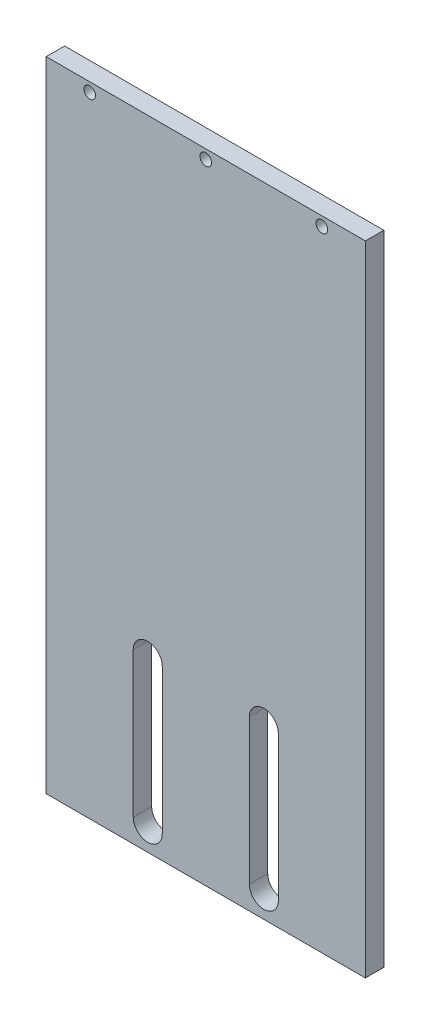
ISO-10303-21;
HEADER;
FILE_DESCRIPTION(('STEP AP214'),'2;1');
FILE_NAME('part.step','',(''),(''),'','','');
FILE_SCHEMA(('AUTOMOTIVE_DESIGN { 1 0 10303 214 1 1 1 1 }'));
ENDSEC;
DATA;
#1=APPLICATION_CONTEXT('core data for automotive mechanical design processes');
#2=APPLICATION_PROTOCOL_DEFINITION('international standard','automotive_design',2000,#1);
#3=PRODUCT_CONTEXT('',#1,'mechanical');
#4=PRODUCT('Part','Part','',(#3));
#5=PRODUCT_RELATED_PRODUCT_CATEGORY('part','',(#4));
#6=PRODUCT_DEFINITION_FORMATION('','',#4);
#7=PRODUCT_DEFINITION_CONTEXT('part definition',#1,'design');
#8=PRODUCT_DEFINITION('design','',#6,#7);
#9=PRODUCT_DEFINITION_SHAPE('','',#8);
#10=(LENGTH_UNIT() NAMED_UNIT(*) SI_UNIT(.MILLI.,.METRE.));
#11=(NAMED_UNIT(*) PLANE_ANGLE_UNIT() SI_UNIT($,.RADIAN.));
#12=(NAMED_UNIT(*) SI_UNIT($,.STERADIAN.) SOLID_ANGLE_UNIT());
#13=UNCERTAINTY_MEASURE_WITH_UNIT(LENGTH_MEASURE(1.E-05),#10,'distance_accuracy_value','');
#14=(GEOMETRIC_REPRESENTATION_CONTEXT(3) GLOBAL_UNCERTAINTY_ASSIGNED_CONTEXT((#13)) GLOBAL_UNIT_ASSIGNED_CONTEXT((#10,
#11,#12)) REPRESENTATION_CONTEXT('',''));
#15=CARTESIAN_POINT('',(0.,0.,0.));
#16=DIRECTION('',(0.,0.,1.));
#17=DIRECTION('',(1.,0.,0.));
#18=AXIS2_PLACEMENT_3D('',#15,#16,#17);
#19=CARTESIAN_POINT('',(0.,0.,6.35));
#20=DIRECTION('',(0.,0.,-1.));
#21=DIRECTION('',(-1.,0.,0.));
#22=AXIS2_PLACEMENT_3D('',#19,#20,#21);
#23=PLANE('',#22);
#24=CARTESIAN_POINT('',(0.,106.825,6.35));
#25=DIRECTION('',(0.,0.,1.));
#26=DIRECTION('',(1.,0.,0.));
#27=AXIS2_PLACEMENT_3D('',#24,#25,#26);
#28=CIRCLE('',#27,2.);
#29=CARTESIAN_POINT('',(2.,106.825,6.35));
#30=VERTEX_POINT('',#29);
#31=EDGE_CURVE('E158',#30,#30,#28,.T.);
#32=ORIENTED_EDGE('',*,*,#31,.F.);
#33=EDGE_LOOP('',(#32));
#34=FACE_BOUND('',#33,.T.);
#35=CARTESIAN_POINT('',(-40.,106.825,6.35));
#36=DIRECTION('',(0.,0.,1.));
#37=DIRECTION('',(1.,0.,0.));
#38=AXIS2_PLACEMENT_3D('',#35,#36,#37);
#39=CIRCLE('',#38,2.);
#40=CARTESIAN_POINT('',(-38.,106.825,6.35));
#41=VERTEX_POINT('',#40);
#42=EDGE_CURVE('E195',#41,#41,#39,.T.);
#43=ORIENTED_EDGE('',*,*,#42,.F.);
#44=EDGE_LOOP('',(#43));
#45=FACE_BOUND('',#44,.T.);
#46=DIRECTION('',(0.,1.,0.));
#47=VECTOR('',#46,1.);
#48=CARTESIAN_POINT('',(55.,-110.,6.35));
#49=LINE('',#48,#47);
#50=CARTESIAN_POINT('',(55.,-110.,6.35));
#51=VERTEX_POINT('',#50);
#52=CARTESIAN_POINT('',(55.,110.,6.35));
#53=VERTEX_POINT('',#52);
#54=EDGE_CURVE('E207',#51,#53,#49,.T.);
#55=ORIENTED_EDGE('',*,*,#54,.T.);
#56=DIRECTION('',(-1.,0.,0.));
#57=VECTOR('',#56,1.);
#58=CARTESIAN_POINT('',(-55.,110.,6.35));
#59=LINE('',#58,#57);
#60=CARTESIAN_POINT('',(-55.,110.,6.35));
#61=VERTEX_POINT('',#60);
#62=EDGE_CURVE('E210',#53,#61,#59,.T.);
#63=ORIENTED_EDGE('',*,*,#62,.T.);
#64=DIRECTION('',(0.,-1.,0.));
#65=VECTOR('',#64,1.);
#66=CARTESIAN_POINT('',(-55.,-110.,6.35));
#67=LINE('',#66,#65);
#68=CARTESIAN_POINT('',(-55.,-110.,6.35));
#69=VERTEX_POINT('',#68);
#70=EDGE_CURVE('E213',#61,#69,#67,.T.);
#71=ORIENTED_EDGE('',*,*,#70,.T.);
#72=DIRECTION('',(1.,0.,0.));
#73=VECTOR('',#72,1.);
#74=CARTESIAN_POINT('',(-55.,-110.,6.35));
#75=LINE('',#74,#73);
#76=EDGE_CURVE('E215',#69,#51,#75,.T.);
#77=ORIENTED_EDGE('',*,*,#76,.T.);
#78=EDGE_LOOP('',(#55,#63,#71,#77));
#79=FACE_BOUND('',#78,.T.);
#80=CARTESIAN_POINT('',(40.,106.825,6.35));
#81=DIRECTION('',(0.,0.,1.));
#82=DIRECTION('',(1.,0.,0.));
#83=AXIS2_PLACEMENT_3D('',#80,#81,#82);
#84=CIRCLE('',#83,2.);
#85=CARTESIAN_POINT('',(42.,106.825,6.35));
#86=VERTEX_POINT('',#85);
#87=EDGE_CURVE('E201',#86,#86,#84,.T.);
#88=ORIENTED_EDGE('',*,*,#87,.F.);
#89=EDGE_LOOP('',(#88));
#90=FACE_BOUND('',#89,.T.);
#91=CARTESIAN_POINT('',(20.,-52.,6.35));
#92=DIRECTION('',(0.,0.,1.));
#93=DIRECTION('',(1.,0.,0.));
#94=AXIS2_PLACEMENT_3D('',#91,#92,#93);
#95=CIRCLE('',#94,5.);
#96=CARTESIAN_POINT('',(25.,-52.,6.35));
#97=VERTEX_POINT('',#96);
#98=CARTESIAN_POINT('',(15.,-52.,6.35));
#99=VERTEX_POINT('',#98);
#100=EDGE_CURVE('E164',#97,#99,#95,.T.);
#101=ORIENTED_EDGE('',*,*,#100,.F.);
#102=DIRECTION('',(0.,1.,0.));
#103=VECTOR('',#102,1.);
#104=CARTESIAN_POINT('',(25.,-102.,6.35));
#105=LINE('',#104,#103);
#106=CARTESIAN_POINT('',(25.,-102.,6.35));
#107=VERTEX_POINT('',#106);
#108=EDGE_CURVE('E172',#107,#97,#105,.T.);
#109=ORIENTED_EDGE('',*,*,#108,.F.);
#110=CARTESIAN_POINT('',(20.,-102.,6.35));
#111=DIRECTION('',(0.,0.,1.));
#112=DIRECTION('',(1.,0.,0.));
#113=AXIS2_PLACEMENT_3D('',#110,#111,#112);
#114=CIRCLE('',#113,5.);
#115=CARTESIAN_POINT('',(15.,-102.,6.35));
#116=VERTEX_POINT('',#115);
#117=EDGE_CURVE('E169',#116,#107,#114,.T.);
#118=ORIENTED_EDGE('',*,*,#117,.F.);
#119=DIRECTION('',(0.,-1.,0.));
#120=VECTOR('',#119,1.);
#121=CARTESIAN_POINT('',(15.,-52.,6.35));
#122=LINE('',#121,#120);
#123=EDGE_CURVE('E166',#99,#116,#122,.T.);
#124=ORIENTED_EDGE('',*,*,#123,.F.);
#125=EDGE_LOOP('',(#101,#109,#118,#124));
#126=FACE_BOUND('',#125,.T.);
#127=CARTESIAN_POINT('',(-20.,-52.,6.35));
#128=DIRECTION('',(0.,0.,1.));
#129=DIRECTION('',(1.,0.,0.));
#130=AXIS2_PLACEMENT_3D('',#127,#128,#129);
#131=CIRCLE('',#130,5.);
#132=CARTESIAN_POINT('',(-15.,-52.,6.35));
#133=VERTEX_POINT('',#132);
#134=CARTESIAN_POINT('',(-25.,-52.,6.35));
#135=VERTEX_POINT('',#134);
#136=EDGE_CURVE('E122',#133,#135,#131,.T.);
#137=ORIENTED_EDGE('',*,*,#136,.F.);
#138=DIRECTION('',(0.,1.,0.));
#139=VECTOR('',#138,1.);
#140=CARTESIAN_POINT('',(-15.,-102.,6.35));
#141=LINE('',#140,#139);
#142=CARTESIAN_POINT('',(-15.,-102.,6.35));
#143=VERTEX_POINT('',#142);
#144=EDGE_CURVE('E144',#143,#133,#141,.T.);
#145=ORIENTED_EDGE('',*,*,#144,.F.);
#146=CARTESIAN_POINT('',(-20.,-102.,6.35));
#147=DIRECTION('',(0.,0.,1.));
#148=DIRECTION('',(1.,0.,0.));
#149=AXIS2_PLACEMENT_3D('',#146,#147,#148);
#150=CIRCLE('',#149,5.);
#151=CARTESIAN_POINT('',(-25.,-102.,6.35));
#152=VERTEX_POINT('',#151);
#153=EDGE_CURVE('E142',#152,#143,#150,.T.);
#154=ORIENTED_EDGE('',*,*,#153,.F.);
#155=DIRECTION('',(0.,-1.,0.));
#156=VECTOR('',#155,1.);
#157=CARTESIAN_POINT('',(-25.,-52.,6.35));
#158=LINE('',#157,#156);
#159=EDGE_CURVE('E130',#135,#152,#158,.T.);
#160=ORIENTED_EDGE('',*,*,#159,.F.);
#161=EDGE_LOOP('',(#137,#145,#154,#160));
#162=FACE_BOUND('',#161,.T.);
#163=ADVANCED_FACE('F33',(#34,#45,#79,#90,#126,#162),#23,.F.);
#164=CARTESIAN_POINT('',(0.,0.,0.));
#165=DIRECTION('',(0.,0.,-1.));
#166=DIRECTION('',(-1.,0.,0.));
#167=AXIS2_PLACEMENT_3D('',#164,#165,#166);
#168=PLANE('',#167);
#169=CARTESIAN_POINT('',(0.,106.825,0.));
#170=DIRECTION('',(0.,0.,1.));
#171=DIRECTION('',(1.,0.,0.));
#172=AXIS2_PLACEMENT_3D('',#169,#170,#171);
#173=CIRCLE('',#172,2.);
#174=CARTESIAN_POINT('',(2.,106.825,0.));
#175=VERTEX_POINT('',#174);
#176=EDGE_CURVE('E138',#175,#175,#173,.T.);
#177=ORIENTED_EDGE('',*,*,#176,.T.);
#178=EDGE_LOOP('',(#177));
#179=FACE_BOUND('',#178,.T.);
#180=CARTESIAN_POINT('',(-40.,106.825,0.));
#181=DIRECTION('',(0.,0.,1.));
#182=DIRECTION('',(1.,0.,0.));
#183=AXIS2_PLACEMENT_3D('',#180,#181,#182);
#184=CIRCLE('',#183,2.);
#185=CARTESIAN_POINT('',(-38.,106.825,0.));
#186=VERTEX_POINT('',#185);
#187=EDGE_CURVE('E194',#186,#186,#184,.T.);
#188=ORIENTED_EDGE('',*,*,#187,.T.);
#189=EDGE_LOOP('',(#188));
#190=FACE_BOUND('',#189,.T.);
#191=DIRECTION('',(0.,1.,0.));
#192=VECTOR('',#191,1.);
#193=CARTESIAN_POINT('',(55.,-110.,0.));
#194=LINE('',#193,#192);
#195=CARTESIAN_POINT('',(55.,-110.,0.));
#196=VERTEX_POINT('',#195);
#197=CARTESIAN_POINT('',(55.,110.,0.));
#198=VERTEX_POINT('',#197);
#199=EDGE_CURVE('E204',#196,#198,#194,.T.);
#200=ORIENTED_EDGE('',*,*,#199,.F.);
#201=DIRECTION('',(1.,0.,0.));
#202=VECTOR('',#201,1.);
#203=CARTESIAN_POINT('',(-55.,-110.,0.));
#204=LINE('',#203,#202);
#205=CARTESIAN_POINT('',(-55.,-110.,0.));
#206=VERTEX_POINT('',#205);
#207=EDGE_CURVE('E211',#206,#196,#204,.T.);
#208=ORIENTED_EDGE('',*,*,#207,.F.);
#209=DIRECTION('',(0.,-1.,0.));
#210=VECTOR('',#209,1.);
#211=CARTESIAN_POINT('',(-55.,-110.,0.));
#212=LINE('',#211,#210);
#213=CARTESIAN_POINT('',(-55.,110.,0.));
#214=VERTEX_POINT('',#213);
#215=EDGE_CURVE('E222',#214,#206,#212,.T.);
#216=ORIENTED_EDGE('',*,*,#215,.F.);
#217=DIRECTION('',(-1.,0.,0.));
#218=VECTOR('',#217,1.);
#219=CARTESIAN_POINT('',(-55.,110.,0.));
#220=LINE('',#219,#218);
#221=EDGE_CURVE('E220',#198,#214,#220,.T.);
#222=ORIENTED_EDGE('',*,*,#221,.F.);
#223=EDGE_LOOP('',(#200,#208,#216,#222));
#224=FACE_BOUND('',#223,.T.);
#225=CARTESIAN_POINT('',(40.,106.825,0.));
#226=DIRECTION('',(0.,0.,1.));
#227=DIRECTION('',(1.,0.,0.));
#228=AXIS2_PLACEMENT_3D('',#225,#226,#227);
#229=CIRCLE('',#228,2.);
#230=CARTESIAN_POINT('',(42.,106.825,0.));
#231=VERTEX_POINT('',#230);
#232=EDGE_CURVE('E198',#231,#231,#229,.T.);
#233=ORIENTED_EDGE('',*,*,#232,.T.);
#234=EDGE_LOOP('',(#233));
#235=FACE_BOUND('',#234,.T.);
#236=DIRECTION('',(0.,1.,0.));
#237=VECTOR('',#236,1.);
#238=CARTESIAN_POINT('',(25.,-102.,0.));
#239=LINE('',#238,#237);
#240=CARTESIAN_POINT('',(25.,-102.,0.));
#241=VERTEX_POINT('',#240);
#242=CARTESIAN_POINT('',(25.,-52.,0.));
#243=VERTEX_POINT('',#242);
#244=EDGE_CURVE('E167',#241,#243,#239,.T.);
#245=ORIENTED_EDGE('',*,*,#244,.T.);
#246=CARTESIAN_POINT('',(20.,-52.,0.));
#247=DIRECTION('',(0.,0.,1.));
#248=DIRECTION('',(1.,0.,0.));
#249=AXIS2_PLACEMENT_3D('',#246,#247,#248);
#250=CIRCLE('',#249,5.);
#251=CARTESIAN_POINT('',(15.,-52.,0.));
#252=VERTEX_POINT('',#251);
#253=EDGE_CURVE('E161',#243,#252,#250,.T.);
#254=ORIENTED_EDGE('',*,*,#253,.T.);
#255=DIRECTION('',(0.,-1.,0.));
#256=VECTOR('',#255,1.);
#257=CARTESIAN_POINT('',(15.,-52.,0.));
#258=LINE('',#257,#256);
#259=CARTESIAN_POINT('',(15.,-102.,0.));
#260=VERTEX_POINT('',#259);
#261=EDGE_CURVE('E177',#252,#260,#258,.T.);
#262=ORIENTED_EDGE('',*,*,#261,.T.);
#263=CARTESIAN_POINT('',(20.,-102.,0.));
#264=DIRECTION('',(0.,0.,1.));
#265=DIRECTION('',(1.,0.,0.));
#266=AXIS2_PLACEMENT_3D('',#263,#264,#265);
#267=CIRCLE('',#266,5.);
#268=EDGE_CURVE('E180',#260,#241,#267,.T.);
#269=ORIENTED_EDGE('',*,*,#268,.T.);
#270=EDGE_LOOP('',(#245,#254,#262,#269));
#271=FACE_BOUND('',#270,.T.);
#272=DIRECTION('',(0.,1.,0.));
#273=VECTOR('',#272,1.);
#274=CARTESIAN_POINT('',(-15.,-102.,0.));
#275=LINE('',#274,#273);
#276=CARTESIAN_POINT('',(-15.,-102.,0.));
#277=VERTEX_POINT('',#276);
#278=CARTESIAN_POINT('',(-15.,-52.,0.));
#279=VERTEX_POINT('',#278);
#280=EDGE_CURVE('E131',#277,#279,#275,.T.);
#281=ORIENTED_EDGE('',*,*,#280,.T.);
#282=CARTESIAN_POINT('',(-20.,-52.,0.));
#283=DIRECTION('',(0.,0.,1.));
#284=DIRECTION('',(1.,0.,0.));
#285=AXIS2_PLACEMENT_3D('',#282,#283,#284);
#286=CIRCLE('',#285,5.);
#287=CARTESIAN_POINT('',(-25.,-52.,0.));
#288=VERTEX_POINT('',#287);
#289=EDGE_CURVE('E56',#279,#288,#286,.T.);
#290=ORIENTED_EDGE('',*,*,#289,.T.);
#291=DIRECTION('',(0.,-1.,0.));
#292=VECTOR('',#291,1.);
#293=CARTESIAN_POINT('',(-25.,-52.,0.));
#294=LINE('',#293,#292);
#295=CARTESIAN_POINT('',(-25.,-102.,0.));
#296=VERTEX_POINT('',#295);
#297=EDGE_CURVE('E137',#288,#296,#294,.T.);
#298=ORIENTED_EDGE('',*,*,#297,.T.);
#299=CARTESIAN_POINT('',(-20.,-102.,0.));
#300=DIRECTION('',(0.,0.,1.));
#301=DIRECTION('',(1.,0.,0.));
#302=AXIS2_PLACEMENT_3D('',#299,#300,#301);
#303=CIRCLE('',#302,5.);
#304=EDGE_CURVE('E150',#296,#277,#303,.T.);
#305=ORIENTED_EDGE('',*,*,#304,.T.);
#306=EDGE_LOOP('',(#281,#290,#298,#305));
#307=FACE_BOUND('',#306,.T.);
#308=ADVANCED_FACE('F240',(#179,#190,#224,#235,#271,#307),#168,.T.);
#309=CARTESIAN_POINT('',(55.,-110.,6.35));
#310=DIRECTION('',(-1.,0.,0.));
#311=DIRECTION('',(0.,0.,1.));
#312=AXIS2_PLACEMENT_3D('',#309,#310,#311);
#313=PLANE('',#312);
#314=ORIENTED_EDGE('',*,*,#199,.T.);
#315=DIRECTION('',(0.,0.,-1.));
#316=VECTOR('',#315,1.);
#317=CARTESIAN_POINT('',(55.,110.,6.35));
#318=LINE('',#317,#316);
#319=EDGE_CURVE('E11',#53,#198,#318,.T.);
#320=ORIENTED_EDGE('',*,*,#319,.F.);
#321=ORIENTED_EDGE('',*,*,#54,.F.);
#322=DIRECTION('',(0.,0.,-1.));
#323=VECTOR('',#322,1.);
#324=CARTESIAN_POINT('',(55.,-110.,6.35));
#325=LINE('',#324,#323);
#326=EDGE_CURVE('E217',#51,#196,#325,.T.);
#327=ORIENTED_EDGE('',*,*,#326,.T.);
#328=EDGE_LOOP('',(#314,#320,#321,#327));
#329=FACE_BOUND('',#328,.T.);
#330=ADVANCED_FACE('F35',(#329),#313,.F.);
#331=CARTESIAN_POINT('',(-55.,110.,6.35));
#332=DIRECTION('',(0.,-1.,0.));
#333=DIRECTION('',(0.,0.,-1.));
#334=AXIS2_PLACEMENT_3D('',#331,#332,#333);
#335=PLANE('',#334);
#336=ORIENTED_EDGE('',*,*,#221,.T.);
#337=DIRECTION('',(0.,0.,-1.));
#338=VECTOR('',#337,1.);
#339=CARTESIAN_POINT('',(-55.,110.,6.35));
#340=LINE('',#339,#338);
#341=EDGE_CURVE('E41',#61,#214,#340,.T.);
#342=ORIENTED_EDGE('',*,*,#341,.F.);
#343=ORIENTED_EDGE('',*,*,#62,.F.);
#344=ORIENTED_EDGE('',*,*,#319,.T.);
#345=EDGE_LOOP('',(#336,#342,#343,#344));
#346=FACE_BOUND('',#345,.T.);
#347=ADVANCED_FACE('F251',(#346),#335,.F.);
#348=CARTESIAN_POINT('',(-55.,-110.,6.35));
#349=DIRECTION('',(1.,0.,0.));
#350=DIRECTION('',(0.,0.,-1.));
#351=AXIS2_PLACEMENT_3D('',#348,#349,#350);
#352=PLANE('',#351);
#353=ORIENTED_EDGE('',*,*,#215,.T.);
#354=DIRECTION('',(0.,0.,-1.));
#355=VECTOR('',#354,1.);
#356=CARTESIAN_POINT('',(-55.,-110.,6.35));
#357=LINE('',#356,#355);
#358=EDGE_CURVE('E227',#69,#206,#357,.T.);
#359=ORIENTED_EDGE('',*,*,#358,.F.);
#360=ORIENTED_EDGE('',*,*,#70,.F.);
#361=ORIENTED_EDGE('',*,*,#341,.T.);
#362=EDGE_LOOP('',(#353,#359,#360,#361));
#363=FACE_BOUND('',#362,.T.);
#364=ADVANCED_FACE('F234',(#363),#352,.F.);
#365=CARTESIAN_POINT('',(-55.,-110.,6.35));
#366=DIRECTION('',(0.,1.,0.));
#367=DIRECTION('',(0.,0.,1.));
#368=AXIS2_PLACEMENT_3D('',#365,#366,#367);
#369=PLANE('',#368);
#370=ORIENTED_EDGE('',*,*,#207,.T.);
#371=ORIENTED_EDGE('',*,*,#326,.F.);
#372=ORIENTED_EDGE('',*,*,#76,.F.);
#373=ORIENTED_EDGE('',*,*,#358,.T.);
#374=EDGE_LOOP('',(#370,#371,#372,#373));
#375=FACE_BOUND('',#374,.T.);
#376=ADVANCED_FACE('F244',(#375),#369,.F.);
#377=CARTESIAN_POINT('',(40.,106.825,6.35));
#378=DIRECTION('',(0.,0.,-1.));
#379=DIRECTION('',(-1.,0.,0.));
#380=AXIS2_PLACEMENT_3D('',#377,#378,#379);
#381=CYLINDRICAL_SURFACE('',#380,2.);
#382=ORIENTED_EDGE('',*,*,#87,.T.);
#383=EDGE_LOOP('',(#382));
#384=FACE_BOUND('',#383,.T.);
#385=ORIENTED_EDGE('',*,*,#232,.F.);
#386=EDGE_LOOP('',(#385));
#387=FACE_BOUND('',#386,.T.);
#388=ADVANCED_FACE('F269',(#384,#387),#381,.F.);
#389=CARTESIAN_POINT('',(-40.,106.825,6.35));
#390=DIRECTION('',(0.,0.,-1.));
#391=DIRECTION('',(-1.,0.,0.));
#392=AXIS2_PLACEMENT_3D('',#389,#390,#391);
#393=CYLINDRICAL_SURFACE('',#392,2.);
#394=ORIENTED_EDGE('',*,*,#42,.T.);
#395=EDGE_LOOP('',(#394));
#396=FACE_BOUND('',#395,.T.);
#397=ORIENTED_EDGE('',*,*,#187,.F.);
#398=EDGE_LOOP('',(#397));
#399=FACE_BOUND('',#398,.T.);
#400=ADVANCED_FACE('F276',(#396,#399),#393,.F.);
#401=CARTESIAN_POINT('',(20.,-52.,6.35));
#402=DIRECTION('',(0.,0.,-1.));
#403=DIRECTION('',(-1.,0.,0.));
#404=AXIS2_PLACEMENT_3D('',#401,#402,#403);
#405=CYLINDRICAL_SURFACE('',#404,5.);
#406=ORIENTED_EDGE('',*,*,#253,.F.);
#407=DIRECTION('',(0.,0.,-1.));
#408=VECTOR('',#407,1.);
#409=CARTESIAN_POINT('',(25.,-52.,6.35));
#410=LINE('',#409,#408);
#411=EDGE_CURVE('E174',#97,#243,#410,.T.);
#412=ORIENTED_EDGE('',*,*,#411,.F.);
#413=ORIENTED_EDGE('',*,*,#100,.T.);
#414=DIRECTION('',(0.,0.,-1.));
#415=VECTOR('',#414,1.);
#416=CARTESIAN_POINT('',(15.,-52.,6.35));
#417=LINE('',#416,#415);
#418=EDGE_CURVE('E191',#99,#252,#417,.T.);
#419=ORIENTED_EDGE('',*,*,#418,.T.);
#420=EDGE_LOOP('',(#406,#412,#413,#419));
#421=FACE_BOUND('',#420,.T.);
#422=ADVANCED_FACE('F281',(#421),#405,.F.);
#423=CARTESIAN_POINT('',(15.,-52.,6.35));
#424=DIRECTION('',(1.,0.,0.));
#425=DIRECTION('',(0.,1.,0.));
#426=AXIS2_PLACEMENT_3D('',#423,#424,#425);
#427=PLANE('',#426);
#428=ORIENTED_EDGE('',*,*,#261,.F.);
#429=ORIENTED_EDGE('',*,*,#418,.F.);
#430=ORIENTED_EDGE('',*,*,#123,.T.);
#431=DIRECTION('',(0.,0.,-1.));
#432=VECTOR('',#431,1.);
#433=CARTESIAN_POINT('',(15.,-102.,6.35));
#434=LINE('',#433,#432);
#435=EDGE_CURVE('E189',#116,#260,#434,.T.);
#436=ORIENTED_EDGE('',*,*,#435,.T.);
#437=EDGE_LOOP('',(#428,#429,#430,#436));
#438=FACE_BOUND('',#437,.T.);
#439=ADVANCED_FACE('F315',(#438),#427,.T.);
#440=CARTESIAN_POINT('',(20.,-102.,6.35));
#441=DIRECTION('',(0.,0.,-1.));
#442=DIRECTION('',(-1.,0.,0.));
#443=AXIS2_PLACEMENT_3D('',#440,#441,#442);
#444=CYLINDRICAL_SURFACE('',#443,5.);
#445=ORIENTED_EDGE('',*,*,#268,.F.);
#446=ORIENTED_EDGE('',*,*,#435,.F.);
#447=ORIENTED_EDGE('',*,*,#117,.T.);
#448=DIRECTION('',(0.,0.,-1.));
#449=VECTOR('',#448,1.);
#450=CARTESIAN_POINT('',(25.,-102.,6.35));
#451=LINE('',#450,#449);
#452=EDGE_CURVE('E187',#107,#241,#451,.T.);
#453=ORIENTED_EDGE('',*,*,#452,.T.);
#454=EDGE_LOOP('',(#445,#446,#447,#453));
#455=FACE_BOUND('',#454,.T.);
#456=ADVANCED_FACE('F311',(#455),#444,.F.);
#457=CARTESIAN_POINT('',(25.,-102.,6.35));
#458=DIRECTION('',(-1.,0.,0.));
#459=DIRECTION('',(0.,-1.,0.));
#460=AXIS2_PLACEMENT_3D('',#457,#458,#459);
#461=PLANE('',#460);
#462=ORIENTED_EDGE('',*,*,#244,.F.);
#463=ORIENTED_EDGE('',*,*,#452,.F.);
#464=ORIENTED_EDGE('',*,*,#108,.T.);
#465=ORIENTED_EDGE('',*,*,#411,.T.);
#466=EDGE_LOOP('',(#462,#463,#464,#465));
#467=FACE_BOUND('',#466,.T.);
#468=ADVANCED_FACE('F307',(#467),#461,.T.);
#469=CARTESIAN_POINT('',(0.,106.825,6.35));
#470=DIRECTION('',(0.,0.,-1.));
#471=DIRECTION('',(-1.,0.,0.));
#472=AXIS2_PLACEMENT_3D('',#469,#470,#471);
#473=CYLINDRICAL_SURFACE('',#472,2.);
#474=ORIENTED_EDGE('',*,*,#31,.T.);
#475=EDGE_LOOP('',(#474));
#476=FACE_BOUND('',#475,.T.);
#477=ORIENTED_EDGE('',*,*,#176,.F.);
#478=EDGE_LOOP('',(#477));
#479=FACE_BOUND('',#478,.T.);
#480=ADVANCED_FACE('F304',(#476,#479),#473,.F.);
#481=CARTESIAN_POINT('',(-20.,-52.,6.35));
#482=DIRECTION('',(0.,0.,-1.));
#483=DIRECTION('',(-1.,0.,0.));
#484=AXIS2_PLACEMENT_3D('',#481,#482,#483);
#485=CYLINDRICAL_SURFACE('',#484,5.);
#486=ORIENTED_EDGE('',*,*,#289,.F.);
#487=DIRECTION('',(0.,0.,-1.));
#488=VECTOR('',#487,1.);
#489=CARTESIAN_POINT('',(-15.,-52.,6.35));
#490=LINE('',#489,#488);
#491=EDGE_CURVE('E126',#133,#279,#490,.T.);
#492=ORIENTED_EDGE('',*,*,#491,.F.);
#493=ORIENTED_EDGE('',*,*,#136,.T.);
#494=DIRECTION('',(0.,0.,-1.));
#495=VECTOR('',#494,1.);
#496=CARTESIAN_POINT('',(-25.,-52.,6.35));
#497=LINE('',#496,#495);
#498=EDGE_CURVE('E125',#135,#288,#497,.T.);
#499=ORIENTED_EDGE('',*,*,#498,.T.);
#500=EDGE_LOOP('',(#486,#492,#493,#499));
#501=FACE_BOUND('',#500,.T.);
#502=ADVANCED_FACE('F124',(#501),#485,.F.);
#503=CARTESIAN_POINT('',(-25.,-52.,6.35));
#504=DIRECTION('',(1.,0.,0.));
#505=DIRECTION('',(0.,1.,0.));
#506=AXIS2_PLACEMENT_3D('',#503,#504,#505);
#507=PLANE('',#506);
#508=ORIENTED_EDGE('',*,*,#297,.F.);
#509=ORIENTED_EDGE('',*,*,#498,.F.);
#510=ORIENTED_EDGE('',*,*,#159,.T.);
#511=DIRECTION('',(0.,0.,-1.));
#512=VECTOR('',#511,1.);
#513=CARTESIAN_POINT('',(-25.,-102.,6.35));
#514=LINE('',#513,#512);
#515=EDGE_CURVE('E139',#152,#296,#514,.T.);
#516=ORIENTED_EDGE('',*,*,#515,.T.);
#517=EDGE_LOOP('',(#508,#509,#510,#516));
#518=FACE_BOUND('',#517,.T.);
#519=ADVANCED_FACE('F134',(#518),#507,.T.);
#520=CARTESIAN_POINT('',(-20.,-102.,6.35));
#521=DIRECTION('',(0.,0.,-1.));
#522=DIRECTION('',(-1.,0.,0.));
#523=AXIS2_PLACEMENT_3D('',#520,#521,#522);
#524=CYLINDRICAL_SURFACE('',#523,5.);
#525=ORIENTED_EDGE('',*,*,#304,.F.);
#526=ORIENTED_EDGE('',*,*,#515,.F.);
#527=ORIENTED_EDGE('',*,*,#153,.T.);
#528=DIRECTION('',(0.,0.,-1.));
#529=VECTOR('',#528,1.);
#530=CARTESIAN_POINT('',(-15.,-102.,6.35));
#531=LINE('',#530,#529);
#532=EDGE_CURVE('E48',#143,#277,#531,.T.);
#533=ORIENTED_EDGE('',*,*,#532,.T.);
#534=EDGE_LOOP('',(#525,#526,#527,#533));
#535=FACE_BOUND('',#534,.T.);
#536=ADVANCED_FACE('F292',(#535),#524,.F.);
#537=CARTESIAN_POINT('',(-15.,-102.,6.35));
#538=DIRECTION('',(-1.,0.,0.));
#539=DIRECTION('',(0.,-1.,0.));
#540=AXIS2_PLACEMENT_3D('',#537,#538,#539);
#541=PLANE('',#540);
#542=ORIENTED_EDGE('',*,*,#280,.F.);
#543=ORIENTED_EDGE('',*,*,#532,.F.);
#544=ORIENTED_EDGE('',*,*,#144,.T.);
#545=ORIENTED_EDGE('',*,*,#491,.T.);
#546=EDGE_LOOP('',(#542,#543,#544,#545));
#547=FACE_BOUND('',#546,.T.);
#548=ADVANCED_FACE('F290',(#547),#541,.T.);
#549=CLOSED_SHELL('',(#163,#308,#330,#347,#364,#376,#388,#400,#422,#439,#456,#468,#480,#502,
#519,#536,#548));
#550=MANIFOLD_SOLID_BREP('B2',#549);
#551=ADVANCED_BREP_SHAPE_REPRESENTATION('',(#18,#550),#14);
#552=SHAPE_DEFINITION_REPRESENTATION(#9,#551);
ENDSEC;
END-ISO-10303-21;
